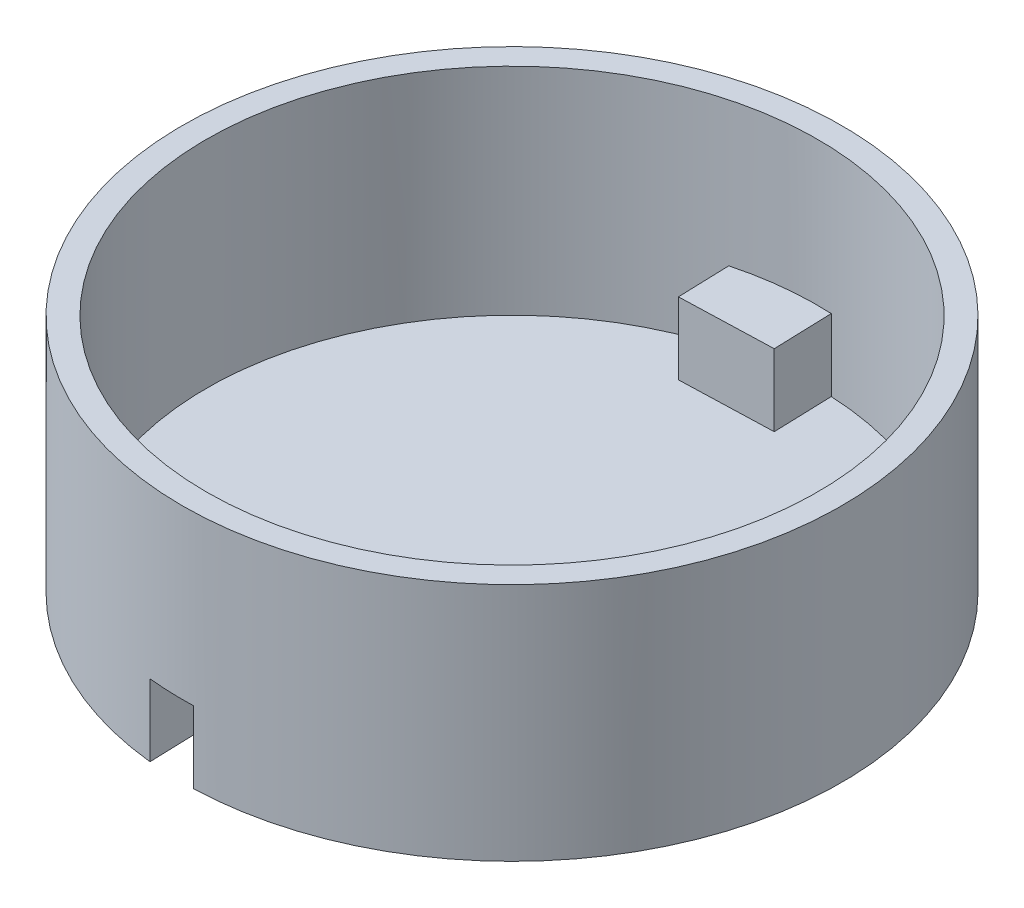
ISO-10303-21;
HEADER;
FILE_DESCRIPTION(('STEP AP214'),'2;1');
FILE_NAME('part.step','',(''),(''),'','','');
FILE_SCHEMA(('AUTOMOTIVE_DESIGN { 1 0 10303 214 1 1 1 1 }'));
ENDSEC;
DATA;
#1=APPLICATION_CONTEXT('core data for automotive mechanical design processes');
#2=APPLICATION_PROTOCOL_DEFINITION('international standard','automotive_design',2000,#1);
#3=PRODUCT_CONTEXT('',#1,'mechanical');
#4=PRODUCT('Part','Part','',(#3));
#5=PRODUCT_RELATED_PRODUCT_CATEGORY('part','',(#4));
#6=PRODUCT_DEFINITION_FORMATION('','',#4);
#7=PRODUCT_DEFINITION_CONTEXT('part definition',#1,'design');
#8=PRODUCT_DEFINITION('design','',#6,#7);
#9=PRODUCT_DEFINITION_SHAPE('','',#8);
#10=(LENGTH_UNIT() NAMED_UNIT(*) SI_UNIT(.MILLI.,.METRE.));
#11=(NAMED_UNIT(*) PLANE_ANGLE_UNIT() SI_UNIT($,.RADIAN.));
#12=(NAMED_UNIT(*) SI_UNIT($,.STERADIAN.) SOLID_ANGLE_UNIT());
#13=UNCERTAINTY_MEASURE_WITH_UNIT(LENGTH_MEASURE(1.E-05),#10,'distance_accuracy_value','');
#14=(GEOMETRIC_REPRESENTATION_CONTEXT(3) GLOBAL_UNCERTAINTY_ASSIGNED_CONTEXT((#13)) GLOBAL_UNIT_ASSIGNED_CONTEXT((#10,
#11,#12)) REPRESENTATION_CONTEXT('',''));
#15=CARTESIAN_POINT('',(0.,0.,0.));
#16=DIRECTION('',(0.,0.,1.));
#17=DIRECTION('',(1.,0.,0.));
#18=AXIS2_PLACEMENT_3D('',#15,#16,#17);
#19=CARTESIAN_POINT('',(0.,20.,0.));
#20=DIRECTION('',(0.,-1.,0.));
#21=DIRECTION('',(0.,0.,-1.));
#22=AXIS2_PLACEMENT_3D('',#19,#20,#21);
#23=CYLINDRICAL_SURFACE('',#22,27.5);
#24=CARTESIAN_POINT('',(0.,0.,0.));
#25=DIRECTION('',(0.,1.,0.));
#26=DIRECTION('',(0.,0.,1.));
#27=AXIS2_PLACEMENT_3D('',#24,#25,#26);
#28=CIRCLE('',#27,27.5);
#29=CARTESIAN_POINT('',(0.894318641789701,0.,27.4854542288634));
#30=VERTEX_POINT('',#29);
#31=CARTESIAN_POINT('',(-0.894318641789704,0.,-27.4854542288634));
#32=VERTEX_POINT('',#31);
#33=EDGE_CURVE('E35',#30,#32,#28,.T.);
#34=ORIENTED_EDGE('',*,*,#33,.T.);
#35=DIRECTION('',(0.,-1.,0.));
#36=VECTOR('',#35,1.);
#37=CARTESIAN_POINT('',(-0.894318641789704,6.,-27.4854542288634));
#38=LINE('',#37,#36);
#39=CARTESIAN_POINT('',(-0.894318641789704,6.,-27.4854542288634));
#40=VERTEX_POINT('',#39);
#41=EDGE_CURVE('E240',#40,#32,#38,.T.);
#42=ORIENTED_EDGE('',*,*,#41,.F.);
#43=CARTESIAN_POINT('',(0.,6.,0.));
#44=DIRECTION('',(0.,-1.,0.));
#45=DIRECTION('',(0.,0.,-1.));
#46=AXIS2_PLACEMENT_3D('',#43,#44,#45);
#47=CIRCLE('',#46,27.5);
#48=CARTESIAN_POINT('',(-4.6339811636827,6.,-27.1067559581488));
#49=VERTEX_POINT('',#48);
#50=EDGE_CURVE('E231',#49,#40,#47,.T.);
#51=ORIENTED_EDGE('',*,*,#50,.F.);
#52=DIRECTION('',(0.,-1.,0.));
#53=VECTOR('',#52,1.);
#54=CARTESIAN_POINT('',(-4.6339811636827,6.,-27.1067559581488));
#55=LINE('',#54,#53);
#56=CARTESIAN_POINT('',(-4.6339811636827,0.,-27.1067559581488));
#57=VERTEX_POINT('',#56);
#58=EDGE_CURVE('E242',#49,#57,#55,.T.);
#59=ORIENTED_EDGE('',*,*,#58,.T.);
#60=CARTESIAN_POINT('',(-2.86205180782551,0.,27.3506610422732));
#61=VERTEX_POINT('',#60);
#62=EDGE_CURVE('E268',#57,#61,#28,.T.);
#63=ORIENTED_EDGE('',*,*,#62,.T.);
#64=DIRECTION('',(0.,-1.,0.));
#65=VECTOR('',#64,1.);
#66=CARTESIAN_POINT('',(-2.86205180782551,6.,27.3506610422732));
#67=LINE('',#66,#65);
#68=CARTESIAN_POINT('',(-2.86205180782551,6.,27.3506610422732));
#69=VERTEX_POINT('',#68);
#70=EDGE_CURVE('E269',#69,#61,#67,.T.);
#71=ORIENTED_EDGE('',*,*,#70,.F.);
#72=CARTESIAN_POINT('',(0.,6.,0.));
#73=DIRECTION('',(0.,-1.,0.));
#74=DIRECTION('',(0.,0.,-1.));
#75=AXIS2_PLACEMENT_3D('',#72,#73,#74);
#76=CIRCLE('',#75,27.5);
#77=CARTESIAN_POINT('',(0.894318641789701,6.,27.4854542288634));
#78=VERTEX_POINT('',#77);
#79=EDGE_CURVE('E255',#78,#69,#76,.T.);
#80=ORIENTED_EDGE('',*,*,#79,.F.);
#81=DIRECTION('',(0.,-1.,0.));
#82=VECTOR('',#81,1.);
#83=CARTESIAN_POINT('',(0.894318641789701,6.,27.4854542288634));
#84=LINE('',#83,#82);
#85=EDGE_CURVE('E272',#78,#30,#84,.T.);
#86=ORIENTED_EDGE('',*,*,#85,.T.);
#87=EDGE_LOOP('',(#34,#42,#51,#59,#63,#71,#80,#86));
#88=FACE_BOUND('',#87,.T.);
#89=CARTESIAN_POINT('',(0.,20.,0.));
#90=DIRECTION('',(0.,1.,0.));
#91=DIRECTION('',(0.,0.,1.));
#92=AXIS2_PLACEMENT_3D('',#89,#90,#91);
#93=CIRCLE('',#92,27.5);
#94=CARTESIAN_POINT('',(0.,20.,27.5));
#95=VERTEX_POINT('',#94);
#96=EDGE_CURVE('E11',#95,#95,#93,.T.);
#97=ORIENTED_EDGE('',*,*,#96,.F.);
#98=EDGE_LOOP('',(#97));
#99=FACE_BOUND('',#98,.T.);
#100=ADVANCED_FACE('F32',(#88,#99),#23,.T.);
#101=CARTESIAN_POINT('',(0.,20.,0.));
#102=DIRECTION('',(0.,1.,0.));
#103=DIRECTION('',(0.,0.,1.));
#104=AXIS2_PLACEMENT_3D('',#101,#102,#103);
#105=PLANE('',#104);
#106=CARTESIAN_POINT('',(0.,20.,0.));
#107=DIRECTION('',(0.,1.,0.));
#108=DIRECTION('',(0.,0.,1.));
#109=AXIS2_PLACEMENT_3D('',#106,#107,#108);
#110=CIRCLE('',#109,25.5);
#111=CARTESIAN_POINT('',(0.,20.,25.5));
#112=VERTEX_POINT('',#111);
#113=EDGE_CURVE('E171',#112,#112,#110,.T.);
#114=ORIENTED_EDGE('',*,*,#113,.F.);
#115=EDGE_LOOP('',(#114));
#116=FACE_BOUND('',#115,.T.);
#117=ORIENTED_EDGE('',*,*,#96,.T.);
#118=EDGE_LOOP('',(#117));
#119=FACE_BOUND('',#118,.T.);
#120=ADVANCED_FACE('F307',(#116,#119),#105,.T.);
#121=CARTESIAN_POINT('',(0.,0.,0.));
#122=DIRECTION('',(0.,1.,0.));
#123=DIRECTION('',(0.,0.,1.));
#124=AXIS2_PLACEMENT_3D('',#121,#122,#123);
#125=PLANE('',#124);
#126=DIRECTION('',(-0.999471062867762,0.,0.0325206778832613));
#127=VECTOR('',#126,1.);
#128=CARTESIAN_POINT('',(-0.731715252373383,0.,-22.4880989145247));
#129=LINE('',#128,#127);
#130=CARTESIAN_POINT('',(-0.731715252373383,0.,-22.4880989145247));
#131=VERTEX_POINT('',#130);
#132=CARTESIAN_POINT('',(-4.47973173812749,0.,-22.3661463724624));
#133=VERTEX_POINT('',#132);
#134=EDGE_CURVE('E236',#131,#133,#129,.T.);
#135=ORIENTED_EDGE('',*,*,#134,.F.);
#136=DIRECTION('',(0.0325206778832625,0.,0.999471062867762));
#137=VECTOR('',#136,1.);
#138=CARTESIAN_POINT('',(-0.731715252373383,0.,-22.4880989145247));
#139=LINE('',#138,#137);
#140=EDGE_CURVE('E46',#32,#131,#139,.T.);
#141=ORIENTED_EDGE('',*,*,#140,.F.);
#142=ORIENTED_EDGE('',*,*,#33,.F.);
#143=DIRECTION('',(0.0325206778832618,0.,0.999471062867762));
#144=VECTOR('',#143,1.);
#145=CARTESIAN_POINT('',(0.73171525237339,0.,22.4880989145246));
#146=LINE('',#145,#144);
#147=CARTESIAN_POINT('',(0.73171525237339,0.,22.4880989145246));
#148=VERTEX_POINT('',#147);
#149=EDGE_CURVE('E262',#148,#30,#146,.T.);
#150=ORIENTED_EDGE('',*,*,#149,.F.);
#151=DIRECTION('',(0.999471062867762,0.,-0.0325206778832613));
#152=VECTOR('',#151,1.);
#153=CARTESIAN_POINT('',(-3.01630123338072,0.,22.6100514565868));
#154=LINE('',#153,#152);
#155=CARTESIAN_POINT('',(-3.01630123338072,0.,22.6100514565868));
#156=VERTEX_POINT('',#155);
#157=EDGE_CURVE('E54',#156,#148,#154,.T.);
#158=ORIENTED_EDGE('',*,*,#157,.F.);
#159=DIRECTION('',(-0.0325206778832617,0.,-0.999471062867762));
#160=VECTOR('',#159,1.);
#161=CARTESIAN_POINT('',(-3.01630123338072,0.,22.6100514565868));
#162=LINE('',#161,#160);
#163=EDGE_CURVE('E252',#61,#156,#162,.T.);
#164=ORIENTED_EDGE('',*,*,#163,.F.);
#165=ORIENTED_EDGE('',*,*,#62,.F.);
#166=DIRECTION('',(-0.0325206778832616,0.,-0.999471062867762));
#167=VECTOR('',#166,1.);
#168=CARTESIAN_POINT('',(-4.47973173812749,0.,-22.3661463724624));
#169=LINE('',#168,#167);
#170=EDGE_CURVE('E225',#133,#57,#169,.T.);
#171=ORIENTED_EDGE('',*,*,#170,.F.);
#172=EDGE_LOOP('',(#135,#141,#142,#150,#158,#164,#165,#171));
#173=FACE_BOUND('',#172,.T.);
#174=ADVANCED_FACE('F283',(#173),#125,.F.);
#175=CARTESIAN_POINT('',(-3.01630123338072,6.,22.6100514565868));
#176=DIRECTION('',(-0.0325206778832613,0.,-0.999471062867762));
#177=DIRECTION('',(-0.999471062867762,0.,0.0325206778832613));
#178=AXIS2_PLACEMENT_3D('',#175,#176,#177);
#179=PLANE('',#178);
#180=ORIENTED_EDGE('',*,*,#157,.T.);
#181=DIRECTION('',(0.,-1.,0.));
#182=VECTOR('',#181,1.);
#183=CARTESIAN_POINT('',(0.73171525237339,6.,22.4880989145246));
#184=LINE('',#183,#182);
#185=CARTESIAN_POINT('',(0.73171525237339,6.,22.4880989145246));
#186=VERTEX_POINT('',#185);
#187=EDGE_CURVE('E260',#186,#148,#184,.T.);
#188=ORIENTED_EDGE('',*,*,#187,.F.);
#189=DIRECTION('',(0.999471062867762,0.,-0.0325206778832613));
#190=VECTOR('',#189,1.);
#191=CARTESIAN_POINT('',(-3.01630123338072,6.,22.6100514565868));
#192=LINE('',#191,#190);
#193=CARTESIAN_POINT('',(-3.01630123338072,6.,22.6100514565868));
#194=VERTEX_POINT('',#193);
#195=EDGE_CURVE('E248',#194,#186,#192,.T.);
#196=ORIENTED_EDGE('',*,*,#195,.F.);
#197=DIRECTION('',(0.,-1.,0.));
#198=VECTOR('',#197,1.);
#199=CARTESIAN_POINT('',(-3.01630123338072,6.,22.6100514565868));
#200=LINE('',#199,#198);
#201=EDGE_CURVE('E266',#194,#156,#200,.T.);
#202=ORIENTED_EDGE('',*,*,#201,.T.);
#203=EDGE_LOOP('',(#180,#188,#196,#202));
#204=FACE_BOUND('',#203,.T.);
#205=ADVANCED_FACE('F299',(#204),#179,.F.);
#206=CARTESIAN_POINT('',(-3.01630123338072,6.,22.6100514565868));
#207=DIRECTION('',(-0.999471062867762,0.,0.0325206778832617));
#208=DIRECTION('',(0.0325206778832617,0.,0.999471062867762));
#209=AXIS2_PLACEMENT_3D('',#206,#207,#208);
#210=PLANE('',#209);
#211=ORIENTED_EDGE('',*,*,#163,.T.);
#212=ORIENTED_EDGE('',*,*,#201,.F.);
#213=DIRECTION('',(-0.0325206778832617,0.,-0.999471062867762));
#214=VECTOR('',#213,1.);
#215=CARTESIAN_POINT('',(-3.01630123338072,6.,22.6100514565868));
#216=LINE('',#215,#214);
#217=EDGE_CURVE('E257',#69,#194,#216,.T.);
#218=ORIENTED_EDGE('',*,*,#217,.F.);
#219=ORIENTED_EDGE('',*,*,#70,.T.);
#220=EDGE_LOOP('',(#211,#212,#218,#219));
#221=FACE_BOUND('',#220,.T.);
#222=ADVANCED_FACE('F296',(#221),#210,.F.);
#223=CARTESIAN_POINT('',(0.73171525237339,6.,22.4880989145246));
#224=DIRECTION('',(0.999471062867762,0.,-0.0325206778832618));
#225=DIRECTION('',(-0.0325206778832618,0.,-0.999471062867762));
#226=AXIS2_PLACEMENT_3D('',#223,#224,#225);
#227=PLANE('',#226);
#228=ORIENTED_EDGE('',*,*,#149,.T.);
#229=ORIENTED_EDGE('',*,*,#85,.F.);
#230=DIRECTION('',(0.0325206778832618,0.,0.999471062867762));
#231=VECTOR('',#230,1.);
#232=CARTESIAN_POINT('',(0.73171525237339,6.,22.4880989145246));
#233=LINE('',#232,#231);
#234=EDGE_CURVE('E251',#186,#78,#233,.T.);
#235=ORIENTED_EDGE('',*,*,#234,.F.);
#236=ORIENTED_EDGE('',*,*,#187,.T.);
#237=EDGE_LOOP('',(#228,#229,#235,#236));
#238=FACE_BOUND('',#237,.T.);
#239=ADVANCED_FACE('F278',(#238),#227,.F.);
#240=CARTESIAN_POINT('',(0.,6.,0.));
#241=DIRECTION('',(0.,-1.,0.));
#242=DIRECTION('',(0.,0.,-1.));
#243=AXIS2_PLACEMENT_3D('',#240,#241,#242);
#244=PLANE('',#243);
#245=ORIENTED_EDGE('',*,*,#195,.T.);
#246=ORIENTED_EDGE('',*,*,#234,.T.);
#247=ORIENTED_EDGE('',*,*,#79,.T.);
#248=ORIENTED_EDGE('',*,*,#217,.T.);
#249=EDGE_LOOP('',(#245,#246,#247,#248));
#250=FACE_BOUND('',#249,.T.);
#251=ADVANCED_FACE('F298',(#250),#244,.T.);
#252=CARTESIAN_POINT('',(-0.731715252373383,6.,-22.4880989145247));
#253=DIRECTION('',(0.999471062867762,0.,-0.0325206778832625));
#254=DIRECTION('',(-0.0325206778832625,0.,-0.999471062867762));
#255=AXIS2_PLACEMENT_3D('',#252,#253,#254);
#256=PLANE('',#255);
#257=ORIENTED_EDGE('',*,*,#140,.T.);
#258=DIRECTION('',(0.,-1.,0.));
#259=VECTOR('',#258,1.);
#260=CARTESIAN_POINT('',(-0.731715252373383,6.,-22.4880989145247));
#261=LINE('',#260,#259);
#262=CARTESIAN_POINT('',(-0.731715252373383,6.,-22.4880989145247));
#263=VERTEX_POINT('',#262);
#264=EDGE_CURVE('E234',#263,#131,#261,.T.);
#265=ORIENTED_EDGE('',*,*,#264,.F.);
#266=DIRECTION('',(0.0325206778832625,0.,0.999471062867762));
#267=VECTOR('',#266,1.);
#268=CARTESIAN_POINT('',(-0.731715252373383,6.,-22.4880989145247));
#269=LINE('',#268,#267);
#270=EDGE_CURVE('E221',#40,#263,#269,.T.);
#271=ORIENTED_EDGE('',*,*,#270,.F.);
#272=ORIENTED_EDGE('',*,*,#41,.T.);
#273=EDGE_LOOP('',(#257,#265,#271,#272));
#274=FACE_BOUND('',#273,.T.);
#275=ADVANCED_FACE('F365',(#274),#256,.F.);
#276=CARTESIAN_POINT('',(-4.47973173812749,6.,-22.3661463724624));
#277=DIRECTION('',(-0.999471062867762,0.,0.0325206778832616));
#278=DIRECTION('',(0.0325206778832616,0.,0.999471062867762));
#279=AXIS2_PLACEMENT_3D('',#276,#277,#278);
#280=PLANE('',#279);
#281=ORIENTED_EDGE('',*,*,#170,.T.);
#282=ORIENTED_EDGE('',*,*,#58,.F.);
#283=DIRECTION('',(-0.0325206778832616,0.,-0.999471062867762));
#284=VECTOR('',#283,1.);
#285=CARTESIAN_POINT('',(-4.47973173812749,6.,-22.3661463724624));
#286=LINE('',#285,#284);
#287=CARTESIAN_POINT('',(-4.47973173812749,6.,-22.3661463724624));
#288=VERTEX_POINT('',#287);
#289=EDGE_CURVE('E228',#288,#49,#286,.T.);
#290=ORIENTED_EDGE('',*,*,#289,.F.);
#291=DIRECTION('',(0.,-1.,0.));
#292=VECTOR('',#291,1.);
#293=CARTESIAN_POINT('',(-4.47973173812749,6.,-22.3661463724624));
#294=LINE('',#293,#292);
#295=EDGE_CURVE('E245',#288,#133,#294,.T.);
#296=ORIENTED_EDGE('',*,*,#295,.T.);
#297=EDGE_LOOP('',(#281,#282,#290,#296));
#298=FACE_BOUND('',#297,.T.);
#299=ADVANCED_FACE('F362',(#298),#280,.F.);
#300=CARTESIAN_POINT('',(-0.731715252373383,6.,-22.4880989145247));
#301=DIRECTION('',(0.0325206778832613,0.,0.999471062867762));
#302=DIRECTION('',(0.999471062867762,0.,-0.0325206778832613));
#303=AXIS2_PLACEMENT_3D('',#300,#301,#302);
#304=PLANE('',#303);
#305=ORIENTED_EDGE('',*,*,#134,.T.);
#306=ORIENTED_EDGE('',*,*,#295,.F.);
#307=DIRECTION('',(-0.999471062867762,0.,0.0325206778832613));
#308=VECTOR('',#307,1.);
#309=CARTESIAN_POINT('',(-0.731715252373383,6.,-22.4880989145247));
#310=LINE('',#309,#308);
#311=EDGE_CURVE('E224',#263,#288,#310,.T.);
#312=ORIENTED_EDGE('',*,*,#311,.F.);
#313=ORIENTED_EDGE('',*,*,#264,.T.);
#314=EDGE_LOOP('',(#305,#306,#312,#313));
#315=FACE_BOUND('',#314,.T.);
#316=ADVANCED_FACE('F329',(#315),#304,.F.);
#317=CARTESIAN_POINT('',(0.,6.,0.));
#318=DIRECTION('',(0.,-1.,0.));
#319=DIRECTION('',(0.,0.,-1.));
#320=AXIS2_PLACEMENT_3D('',#317,#318,#319);
#321=PLANE('',#320);
#322=ORIENTED_EDGE('',*,*,#270,.T.);
#323=ORIENTED_EDGE('',*,*,#311,.T.);
#324=ORIENTED_EDGE('',*,*,#289,.T.);
#325=ORIENTED_EDGE('',*,*,#50,.T.);
#326=EDGE_LOOP('',(#322,#323,#324,#325));
#327=FACE_BOUND('',#326,.T.);
#328=ADVANCED_FACE('F321',(#327),#321,.T.);
#329=CARTESIAN_POINT('',(0.,20.,0.));
#330=DIRECTION('',(0.,-1.,0.));
#331=DIRECTION('',(0.,0.,-1.));
#332=AXIS2_PLACEMENT_3D('',#329,#330,#331);
#333=CYLINDRICAL_SURFACE('',#332,25.5);
#334=CARTESIAN_POINT('',(0.,2.,0.));
#335=DIRECTION('',(0.,1.,0.));
#336=DIRECTION('',(0.,0.,1.));
#337=AXIS2_PLACEMENT_3D('',#334,#335,#336);
#338=CIRCLE('',#337,25.5);
#339=CARTESIAN_POINT('',(2.82566483568972,2.,25.3429599343949));
#340=VERTEX_POINT('',#339);
#341=CARTESIAN_POINT('',(1.17221941578133,2.,-25.473042645928));
#342=VERTEX_POINT('',#341);
#343=EDGE_CURVE('E150',#340,#342,#338,.T.);
#344=ORIENTED_EDGE('',*,*,#343,.F.);
#345=DIRECTION('',(0.,-1.,0.));
#346=VECTOR('',#345,1.);
#347=CARTESIAN_POINT('',(2.82566483568972,8.,25.3429599343949));
#348=LINE('',#347,#346);
#349=CARTESIAN_POINT('',(2.82566483568972,8.,25.3429599343949));
#350=VERTEX_POINT('',#349);
#351=EDGE_CURVE('E187',#350,#340,#348,.T.);
#352=ORIENTED_EDGE('',*,*,#351,.F.);
#353=CARTESIAN_POINT('',(0.,8.,0.));
#354=DIRECTION('',(0.,-1.,0.));
#355=DIRECTION('',(0.,0.,-1.));
#356=AXIS2_PLACEMENT_3D('',#353,#354,#355);
#357=CIRCLE('',#356,25.5);
#358=CARTESIAN_POINT('',(-4.93903899959203,8.,25.0171120187864));
#359=VERTEX_POINT('',#358);
#360=EDGE_CURVE('E188',#350,#359,#357,.T.);
#361=ORIENTED_EDGE('',*,*,#360,.T.);
#362=DIRECTION('',(0.,-1.,0.));
#363=VECTOR('',#362,1.);
#364=CARTESIAN_POINT('',(-4.93903899959203,8.,25.0171120187864));
#365=LINE('',#364,#363);
#366=CARTESIAN_POINT('',(-4.93903899959203,2.,25.0171120187864));
#367=VERTEX_POINT('',#366);
#368=EDGE_CURVE('E184',#359,#367,#365,.T.);
#369=ORIENTED_EDGE('',*,*,#368,.T.);
#370=CARTESIAN_POINT('',(0.,2.,0.));
#371=DIRECTION('',(0.,1.,0.));
#372=DIRECTION('',(0.,0.,1.));
#373=AXIS2_PLACEMENT_3D('',#370,#371,#372);
#374=CIRCLE('',#373,25.5);
#375=CARTESIAN_POINT('',(-6.55487822338723,2.,-24.6431242231289));
#376=VERTEX_POINT('',#375);
#377=EDGE_CURVE('E172',#376,#367,#374,.T.);
#378=ORIENTED_EDGE('',*,*,#377,.F.);
#379=DIRECTION('',(0.,-1.,0.));
#380=VECTOR('',#379,1.);
#381=CARTESIAN_POINT('',(-6.55487822338723,8.,-24.6431242231289));
#382=LINE('',#381,#380);
#383=CARTESIAN_POINT('',(-6.55487822338723,8.,-24.6431242231289));
#384=VERTEX_POINT('',#383);
#385=EDGE_CURVE('E156',#384,#376,#382,.T.);
#386=ORIENTED_EDGE('',*,*,#385,.F.);
#387=CARTESIAN_POINT('',(0.,8.,0.));
#388=DIRECTION('',(0.,-1.,0.));
#389=DIRECTION('',(0.,0.,-1.));
#390=AXIS2_PLACEMENT_3D('',#387,#388,#389);
#391=CIRCLE('',#390,25.5);
#392=CARTESIAN_POINT('',(1.17221941578133,8.,-25.473042645928));
#393=VERTEX_POINT('',#392);
#394=EDGE_CURVE('E152',#384,#393,#391,.T.);
#395=ORIENTED_EDGE('',*,*,#394,.T.);
#396=DIRECTION('',(0.,-1.,0.));
#397=VECTOR('',#396,1.);
#398=CARTESIAN_POINT('',(1.17221941578133,8.,-25.473042645928));
#399=LINE('',#398,#397);
#400=EDGE_CURVE('E145',#393,#342,#399,.T.);
#401=ORIENTED_EDGE('',*,*,#400,.T.);
#402=EDGE_LOOP('',(#344,#352,#361,#369,#378,#386,#395,#401));
#403=FACE_BOUND('',#402,.T.);
#404=ORIENTED_EDGE('',*,*,#113,.T.);
#405=EDGE_LOOP('',(#404));
#406=FACE_BOUND('',#405,.T.);
#407=ADVANCED_FACE('F147',(#403,#406),#333,.F.);
#408=CARTESIAN_POINT('',(0.,2.,0.));
#409=DIRECTION('',(0.,1.,0.));
#410=DIRECTION('',(0.,0.,1.));
#411=AXIS2_PLACEMENT_3D('',#408,#409,#410);
#412=PLANE('',#411);
#413=DIRECTION('',(-0.999471062867762,0.,0.0325206778832613));
#414=VECTOR('',#413,1.);
#415=CARTESIAN_POINT('',(-0.666673896606861,2.,-20.4891567887891));
#416=LINE('',#415,#414);
#417=CARTESIAN_POINT('',(1.33226822912866,2.,-20.5541981445557));
#418=VERTEX_POINT('',#417);
#419=CARTESIAN_POINT('',(-6.41363250809649,2.,-20.3021628909604));
#420=VERTEX_POINT('',#419);
#421=EDGE_CURVE('E165',#418,#420,#416,.T.);
#422=ORIENTED_EDGE('',*,*,#421,.T.);
#423=DIRECTION('',(-0.0325206778832616,0.,-0.999471062867762));
#424=VECTOR('',#423,1.);
#425=CARTESIAN_POINT('',(-6.47867386386302,2.,-22.3011050166959));
#426=LINE('',#425,#424);
#427=EDGE_CURVE('E194',#420,#376,#426,.T.);
#428=ORIENTED_EDGE('',*,*,#427,.T.);
#429=ORIENTED_EDGE('',*,*,#377,.T.);
#430=DIRECTION('',(-0.0325206778832617,0.,-0.999471062867762));
#431=VECTOR('',#430,1.);
#432=CARTESIAN_POINT('',(-5.01524335911624,2.,22.6750928123534));
#433=LINE('',#432,#431);
#434=CARTESIAN_POINT('',(-5.08028471488277,2.,20.6761506866178));
#435=VERTEX_POINT('',#434);
#436=EDGE_CURVE('E197',#367,#435,#433,.T.);
#437=ORIENTED_EDGE('',*,*,#436,.T.);
#438=DIRECTION('',(0.999471062867762,0.,-0.0325206778832613));
#439=VECTOR('',#438,1.);
#440=CARTESIAN_POINT('',(-3.08134258914724,2.,20.6111093308513));
#441=LINE('',#440,#439);
#442=CARTESIAN_POINT('',(2.66561602234239,2.,20.4241154330226));
#443=VERTEX_POINT('',#442);
#444=EDGE_CURVE('E155',#435,#443,#441,.T.);
#445=ORIENTED_EDGE('',*,*,#444,.T.);
#446=DIRECTION('',(0.0325206778832618,0.,0.999471062867762));
#447=VECTOR('',#446,1.);
#448=CARTESIAN_POINT('',(2.73065737810891,2.,22.4230575587581));
#449=LINE('',#448,#447);
#450=EDGE_CURVE('E169',#443,#340,#449,.T.);
#451=ORIENTED_EDGE('',*,*,#450,.T.);
#452=ORIENTED_EDGE('',*,*,#343,.T.);
#453=DIRECTION('',(0.0325206778832625,0.,0.999471062867762));
#454=VECTOR('',#453,1.);
#455=CARTESIAN_POINT('',(1.26722687336214,2.,-22.5531402702912));
#456=LINE('',#455,#454);
#457=EDGE_CURVE('E159',#342,#418,#456,.T.);
#458=ORIENTED_EDGE('',*,*,#457,.T.);
#459=EDGE_LOOP('',(#422,#428,#429,#437,#445,#451,#452,#458));
#460=FACE_BOUND('',#459,.T.);
#461=ADVANCED_FACE('F167',(#460),#412,.T.);
#462=CARTESIAN_POINT('',(-3.08134258914724,6.,20.6111093308513));
#463=DIRECTION('',(-0.0325206778832613,0.,-0.999471062867762));
#464=DIRECTION('',(-0.999471062867762,0.,0.0325206778832613));
#465=AXIS2_PLACEMENT_3D('',#462,#463,#464);
#466=PLANE('',#465);
#467=ORIENTED_EDGE('',*,*,#444,.F.);
#468=DIRECTION('',(0.,-1.,0.));
#469=VECTOR('',#468,1.);
#470=CARTESIAN_POINT('',(-5.08028471488277,6.,20.6761506866178));
#471=LINE('',#470,#469);
#472=CARTESIAN_POINT('',(-5.08028471488277,8.,20.6761506866178));
#473=VERTEX_POINT('',#472);
#474=EDGE_CURVE('E176',#473,#435,#471,.T.);
#475=ORIENTED_EDGE('',*,*,#474,.F.);
#476=DIRECTION('',(0.999471062867762,0.,-0.0325206778832613));
#477=VECTOR('',#476,1.);
#478=CARTESIAN_POINT('',(0.666673896606856,8.,20.4891567887891));
#479=LINE('',#478,#477);
#480=CARTESIAN_POINT('',(2.66561602234239,8.,20.4241154330226));
#481=VERTEX_POINT('',#480);
#482=EDGE_CURVE('E201',#473,#481,#479,.T.);
#483=ORIENTED_EDGE('',*,*,#482,.T.);
#484=DIRECTION('',(0.,-1.,0.));
#485=VECTOR('',#484,1.);
#486=CARTESIAN_POINT('',(2.66561602234239,6.,20.4241154330226));
#487=LINE('',#486,#485);
#488=EDGE_CURVE('E193',#481,#443,#487,.T.);
#489=ORIENTED_EDGE('',*,*,#488,.T.);
#490=EDGE_LOOP('',(#467,#475,#483,#489));
#491=FACE_BOUND('',#490,.T.);
#492=ADVANCED_FACE('F327',(#491),#466,.T.);
#493=CARTESIAN_POINT('',(-5.01524335911624,6.,22.6750928123534));
#494=DIRECTION('',(-0.999471062867762,0.,0.0325206778832617));
#495=DIRECTION('',(0.0325206778832617,0.,0.999471062867762));
#496=AXIS2_PLACEMENT_3D('',#493,#494,#495);
#497=PLANE('',#496);
#498=ORIENTED_EDGE('',*,*,#436,.F.);
#499=ORIENTED_EDGE('',*,*,#368,.F.);
#500=DIRECTION('',(-0.0325206778832617,0.,-0.999471062867762));
#501=VECTOR('',#500,1.);
#502=CARTESIAN_POINT('',(-5.74695861148963,8.,0.186993897828755));
#503=LINE('',#502,#501);
#504=EDGE_CURVE('E190',#359,#473,#503,.T.);
#505=ORIENTED_EDGE('',*,*,#504,.T.);
#506=ORIENTED_EDGE('',*,*,#474,.T.);
#507=EDGE_LOOP('',(#498,#499,#505,#506));
#508=FACE_BOUND('',#507,.T.);
#509=ADVANCED_FACE('F335',(#508),#497,.T.);
#510=CARTESIAN_POINT('',(2.73065737810891,6.,22.4230575587581));
#511=DIRECTION('',(0.999471062867762,0.,-0.0325206778832618));
#512=DIRECTION('',(-0.0325206778832618,0.,-0.999471062867762));
#513=AXIS2_PLACEMENT_3D('',#510,#511,#512);
#514=PLANE('',#513);
#515=ORIENTED_EDGE('',*,*,#450,.F.);
#516=ORIENTED_EDGE('',*,*,#488,.F.);
#517=DIRECTION('',(0.0325206778832618,0.,0.999471062867762));
#518=VECTOR('',#517,1.);
#519=CARTESIAN_POINT('',(1.99894212573552,8.,-0.0650413557665237));
#520=LINE('',#519,#518);
#521=EDGE_CURVE('E191',#481,#350,#520,.T.);
#522=ORIENTED_EDGE('',*,*,#521,.T.);
#523=ORIENTED_EDGE('',*,*,#351,.T.);
#524=EDGE_LOOP('',(#515,#516,#522,#523));
#525=FACE_BOUND('',#524,.T.);
#526=ADVANCED_FACE('F339',(#525),#514,.T.);
#527=CARTESIAN_POINT('',(0.,8.,0.));
#528=DIRECTION('',(0.,-1.,0.));
#529=DIRECTION('',(0.,0.,-1.));
#530=AXIS2_PLACEMENT_3D('',#527,#528,#529);
#531=PLANE('',#530);
#532=ORIENTED_EDGE('',*,*,#482,.F.);
#533=ORIENTED_EDGE('',*,*,#504,.F.);
#534=ORIENTED_EDGE('',*,*,#360,.F.);
#535=ORIENTED_EDGE('',*,*,#521,.F.);
#536=EDGE_LOOP('',(#532,#533,#534,#535));
#537=FACE_BOUND('',#536,.T.);
#538=ADVANCED_FACE('F343',(#537),#531,.F.);
#539=CARTESIAN_POINT('',(1.26722687336214,6.,-22.5531402702912));
#540=DIRECTION('',(0.999471062867762,0.,-0.0325206778832625));
#541=DIRECTION('',(-0.0325206778832625,0.,-0.999471062867762));
#542=AXIS2_PLACEMENT_3D('',#539,#540,#541);
#543=PLANE('',#542);
#544=ORIENTED_EDGE('',*,*,#457,.F.);
#545=ORIENTED_EDGE('',*,*,#400,.F.);
#546=DIRECTION('',(0.0325206778832625,0.,0.999471062867762));
#547=VECTOR('',#546,1.);
#548=CARTESIAN_POINT('',(1.99894212573555,8.,-0.0650413557665257));
#549=LINE('',#548,#547);
#550=CARTESIAN_POINT('',(1.33226822912866,8.,-20.5541981445557));
#551=VERTEX_POINT('',#550);
#552=EDGE_CURVE('E203',#393,#551,#549,.T.);
#553=ORIENTED_EDGE('',*,*,#552,.T.);
#554=DIRECTION('',(0.,-1.,0.));
#555=VECTOR('',#554,1.);
#556=CARTESIAN_POINT('',(1.33226822912866,6.,-20.5541981445557));
#557=LINE('',#556,#555);
#558=EDGE_CURVE('E161',#551,#418,#557,.T.);
#559=ORIENTED_EDGE('',*,*,#558,.T.);
#560=EDGE_LOOP('',(#544,#545,#553,#559));
#561=FACE_BOUND('',#560,.T.);
#562=ADVANCED_FACE('F160',(#561),#543,.T.);
#563=CARTESIAN_POINT('',(-6.47867386386302,6.,-22.3011050166959));
#564=DIRECTION('',(-0.999471062867762,0.,0.0325206778832616));
#565=DIRECTION('',(0.0325206778832616,0.,0.999471062867762));
#566=AXIS2_PLACEMENT_3D('',#563,#564,#565);
#567=PLANE('',#566);
#568=ORIENTED_EDGE('',*,*,#427,.F.);
#569=DIRECTION('',(0.,-1.,0.));
#570=VECTOR('',#569,1.);
#571=CARTESIAN_POINT('',(-6.41363250809649,6.,-20.3021628909604));
#572=LINE('',#571,#570);
#573=CARTESIAN_POINT('',(-6.41363250809649,8.,-20.3021628909604));
#574=VERTEX_POINT('',#573);
#575=EDGE_CURVE('E182',#574,#420,#572,.T.);
#576=ORIENTED_EDGE('',*,*,#575,.F.);
#577=DIRECTION('',(-0.0325206778832616,0.,-0.999471062867762));
#578=VECTOR('',#577,1.);
#579=CARTESIAN_POINT('',(-5.74695861148963,8.,0.186993897828754));
#580=LINE('',#579,#578);
#581=EDGE_CURVE('E180',#574,#384,#580,.T.);
#582=ORIENTED_EDGE('',*,*,#581,.T.);
#583=ORIENTED_EDGE('',*,*,#385,.T.);
#584=EDGE_LOOP('',(#568,#576,#582,#583));
#585=FACE_BOUND('',#584,.T.);
#586=ADVANCED_FACE('F350',(#585),#567,.T.);
#587=CARTESIAN_POINT('',(-0.666673896606861,6.,-20.4891567887891));
#588=DIRECTION('',(0.0325206778832613,0.,0.999471062867762));
#589=DIRECTION('',(0.999471062867762,0.,-0.0325206778832613));
#590=AXIS2_PLACEMENT_3D('',#587,#588,#589);
#591=PLANE('',#590);
#592=ORIENTED_EDGE('',*,*,#421,.F.);
#593=ORIENTED_EDGE('',*,*,#558,.F.);
#594=DIRECTION('',(-0.999471062867762,0.,0.0325206778832613));
#595=VECTOR('',#594,1.);
#596=CARTESIAN_POINT('',(-0.666673896606858,8.,-20.4891567887891));
#597=LINE('',#596,#595);
#598=EDGE_CURVE('E215',#551,#574,#597,.T.);
#599=ORIENTED_EDGE('',*,*,#598,.T.);
#600=ORIENTED_EDGE('',*,*,#575,.T.);
#601=EDGE_LOOP('',(#592,#593,#599,#600));
#602=FACE_BOUND('',#601,.T.);
#603=ADVANCED_FACE('F353',(#602),#591,.T.);
#604=CARTESIAN_POINT('',(0.,8.,0.));
#605=DIRECTION('',(0.,-1.,0.));
#606=DIRECTION('',(0.,0.,-1.));
#607=AXIS2_PLACEMENT_3D('',#604,#605,#606);
#608=PLANE('',#607);
#609=ORIENTED_EDGE('',*,*,#552,.F.);
#610=ORIENTED_EDGE('',*,*,#394,.F.);
#611=ORIENTED_EDGE('',*,*,#581,.F.);
#612=ORIENTED_EDGE('',*,*,#598,.F.);
#613=EDGE_LOOP('',(#609,#610,#611,#612));
#614=FACE_BOUND('',#613,.T.);
#615=ADVANCED_FACE('F357',(#614),#608,.F.);
#616=CLOSED_SHELL('',(#100,#120,#174,#205,#222,#239,#251,#275,#299,#316,#328,#407,#461,#492,
#509,#526,#538,#562,#586,#603,#615));
#617=MANIFOLD_SOLID_BREP('B2',#616);
#618=ADVANCED_BREP_SHAPE_REPRESENTATION('',(#18,#617),#14);
#619=SHAPE_DEFINITION_REPRESENTATION(#9,#618);
ENDSEC;
END-ISO-10303-21;
